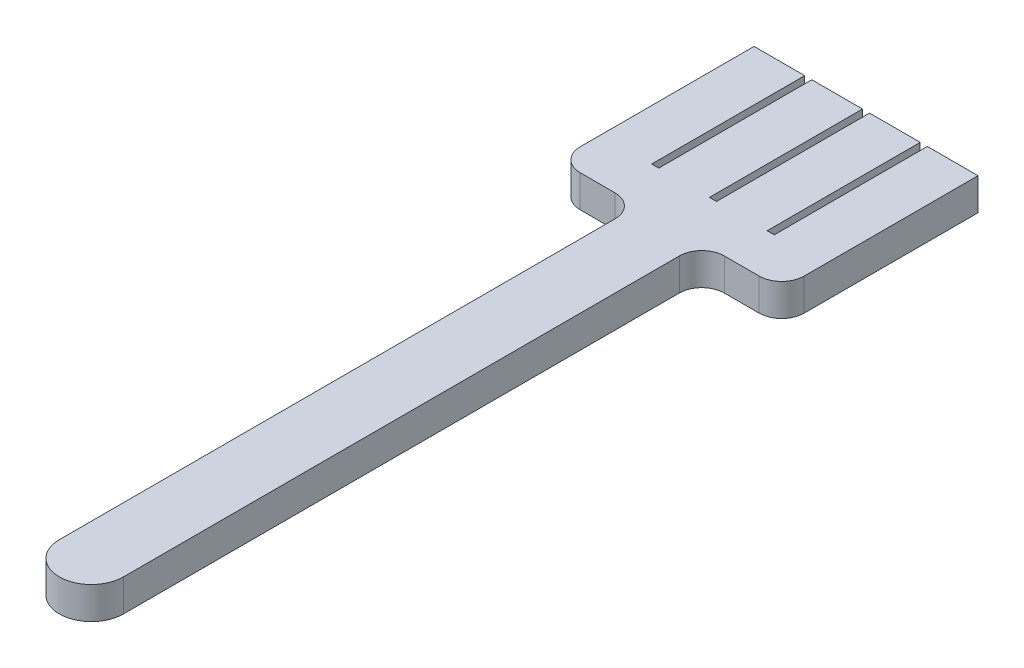
ISO-10303-21;
HEADER;
FILE_DESCRIPTION(('STEP AP214'),'2;1');
FILE_NAME('part.step','',(''),(''),'','','');
FILE_SCHEMA(('AUTOMOTIVE_DESIGN { 1 0 10303 214 1 1 1 1 }'));
ENDSEC;
DATA;
#1=APPLICATION_CONTEXT('core data for automotive mechanical design processes');
#2=APPLICATION_PROTOCOL_DEFINITION('international standard','automotive_design',2000,#1);
#3=PRODUCT_CONTEXT('',#1,'mechanical');
#4=PRODUCT('Part','Part','',(#3));
#5=PRODUCT_RELATED_PRODUCT_CATEGORY('part','',(#4));
#6=PRODUCT_DEFINITION_FORMATION('','',#4);
#7=PRODUCT_DEFINITION_CONTEXT('part definition',#1,'design');
#8=PRODUCT_DEFINITION('design','',#6,#7);
#9=PRODUCT_DEFINITION_SHAPE('','',#8);
#10=(LENGTH_UNIT() NAMED_UNIT(*) SI_UNIT(.MILLI.,.METRE.));
#11=(NAMED_UNIT(*) PLANE_ANGLE_UNIT() SI_UNIT($,.RADIAN.));
#12=(NAMED_UNIT(*) SI_UNIT($,.STERADIAN.) SOLID_ANGLE_UNIT());
#13=UNCERTAINTY_MEASURE_WITH_UNIT(LENGTH_MEASURE(1.E-05),#10,'distance_accuracy_value','');
#14=(GEOMETRIC_REPRESENTATION_CONTEXT(3) GLOBAL_UNCERTAINTY_ASSIGNED_CONTEXT((#13)) GLOBAL_UNIT_ASSIGNED_CONTEXT((#10,
#11,#12)) REPRESENTATION_CONTEXT('',''));
#15=CARTESIAN_POINT('',(0.,0.,0.));
#16=DIRECTION('',(0.,0.,1.));
#17=DIRECTION('',(1.,0.,0.));
#18=AXIS2_PLACEMENT_3D('',#15,#16,#17);
#19=CARTESIAN_POINT('',(10.,10.,0.));
#20=DIRECTION('',(0.,-1.,0.));
#21=DIRECTION('',(0.,0.,-1.));
#22=AXIS2_PLACEMENT_3D('',#19,#20,#21);
#23=CYLINDRICAL_SURFACE('',#22,10.);
#24=CARTESIAN_POINT('',(10.,0.,0.));
#25=DIRECTION('',(0.,1.,0.));
#26=DIRECTION('',(0.,0.,-1.));
#27=AXIS2_PLACEMENT_3D('',#24,#25,#26);
#28=CIRCLE('',#27,10.);
#29=CARTESIAN_POINT('',(0.,0.,0.));
#30=VERTEX_POINT('',#29);
#31=CARTESIAN_POINT('',(20.,0.,0.));
#32=VERTEX_POINT('',#31);
#33=EDGE_CURVE('E221',#30,#32,#28,.T.);
#34=ORIENTED_EDGE('',*,*,#33,.T.);
#35=DIRECTION('',(0.,-1.,0.));
#36=VECTOR('',#35,1.);
#37=CARTESIAN_POINT('',(20.,10.,0.));
#38=LINE('',#37,#36);
#39=CARTESIAN_POINT('',(20.,10.,0.));
#40=VERTEX_POINT('',#39);
#41=EDGE_CURVE('E203',#40,#32,#38,.T.);
#42=ORIENTED_EDGE('',*,*,#41,.F.);
#43=CARTESIAN_POINT('',(10.,10.,0.));
#44=DIRECTION('',(0.,1.,0.));
#45=DIRECTION('',(0.,0.,-1.));
#46=AXIS2_PLACEMENT_3D('',#43,#44,#45);
#47=CIRCLE('',#46,10.);
#48=CARTESIAN_POINT('',(0.,10.,0.));
#49=VERTEX_POINT('',#48);
#50=EDGE_CURVE('E209',#49,#40,#47,.T.);
#51=ORIENTED_EDGE('',*,*,#50,.F.);
#52=DIRECTION('',(0.,-1.,0.));
#53=VECTOR('',#52,1.);
#54=CARTESIAN_POINT('',(0.,10.,0.));
#55=LINE('',#54,#53);
#56=EDGE_CURVE('E308',#49,#30,#55,.T.);
#57=ORIENTED_EDGE('',*,*,#56,.T.);
#58=EDGE_LOOP('',(#34,#42,#51,#57));
#59=FACE_BOUND('',#58,.T.);
#60=ADVANCED_FACE('F35',(#59),#23,.T.);
#61=CARTESIAN_POINT('',(20.,10.,-180.));
#62=DIRECTION('',(-1.,0.,0.));
#63=DIRECTION('',(0.,0.,1.));
#64=AXIS2_PLACEMENT_3D('',#61,#62,#63);
#65=PLANE('',#64);
#66=DIRECTION('',(0.,0.,-1.));
#67=VECTOR('',#66,1.);
#68=CARTESIAN_POINT('',(20.,0.,-180.));
#69=LINE('',#68,#67);
#70=CARTESIAN_POINT('',(20.,0.,-173.));
#71=VERTEX_POINT('',#70);
#72=EDGE_CURVE('E261',#32,#71,#69,.T.);
#73=ORIENTED_EDGE('',*,*,#72,.T.);
#74=DIRECTION('',(0.,-1.,0.));
#75=VECTOR('',#74,1.);
#76=CARTESIAN_POINT('',(20.,10.,-173.));
#77=LINE('',#76,#75);
#78=CARTESIAN_POINT('',(20.,10.,-173.));
#79=VERTEX_POINT('',#78);
#80=EDGE_CURVE('E206',#71,#79,#77,.F.);
#81=ORIENTED_EDGE('',*,*,#80,.T.);
#82=DIRECTION('',(0.,0.,-1.));
#83=VECTOR('',#82,1.);
#84=CARTESIAN_POINT('',(20.,10.,-180.));
#85=LINE('',#84,#83);
#86=EDGE_CURVE('E198',#40,#79,#85,.T.);
#87=ORIENTED_EDGE('',*,*,#86,.F.);
#88=ORIENTED_EDGE('',*,*,#41,.T.);
#89=EDGE_LOOP('',(#73,#81,#87,#88));
#90=FACE_BOUND('',#89,.T.);
#91=ADVANCED_FACE('F201',(#90),#65,.F.);
#92=CARTESIAN_POINT('',(44.8495337603184,10.,-180.));
#93=DIRECTION('',(0.,0.,-1.));
#94=DIRECTION('',(-1.,0.,0.));
#95=AXIS2_PLACEMENT_3D('',#92,#93,#94);
#96=PLANE('',#95);
#97=DIRECTION('',(1.,0.,0.));
#98=VECTOR('',#97,1.);
#99=CARTESIAN_POINT('',(44.8495337603184,10.,-180.));
#100=LINE('',#99,#98);
#101=CARTESIAN_POINT('',(27.,10.,-180.));
#102=VERTEX_POINT('',#101);
#103=CARTESIAN_POINT('',(37.8495337603184,10.,-180.));
#104=VERTEX_POINT('',#103);
#105=EDGE_CURVE('E208',#102,#104,#100,.T.);
#106=ORIENTED_EDGE('',*,*,#105,.F.);
#107=DIRECTION('',(0.,-1.,0.));
#108=VECTOR('',#107,1.);
#109=CARTESIAN_POINT('',(27.,0.,-180.));
#110=LINE('',#109,#108);
#111=CARTESIAN_POINT('',(27.,0.,-180.));
#112=VERTEX_POINT('',#111);
#113=EDGE_CURVE('E239',#102,#112,#110,.T.);
#114=ORIENTED_EDGE('',*,*,#113,.T.);
#115=DIRECTION('',(1.,0.,0.));
#116=VECTOR('',#115,1.);
#117=CARTESIAN_POINT('',(44.8495337603184,0.,-180.));
#118=LINE('',#117,#116);
#119=CARTESIAN_POINT('',(37.8495337603184,0.,-180.));
#120=VERTEX_POINT('',#119);
#121=EDGE_CURVE('E263',#112,#120,#118,.T.);
#122=ORIENTED_EDGE('',*,*,#121,.T.);
#123=DIRECTION('',(0.,-1.,0.));
#124=VECTOR('',#123,1.);
#125=CARTESIAN_POINT('',(37.8495337603184,10.,-180.));
#126=LINE('',#125,#124);
#127=EDGE_CURVE('E237',#120,#104,#126,.F.);
#128=ORIENTED_EDGE('',*,*,#127,.T.);
#129=EDGE_LOOP('',(#106,#114,#122,#128));
#130=FACE_BOUND('',#129,.T.);
#131=ADVANCED_FACE('F270',(#130),#96,.F.);
#132=CARTESIAN_POINT('',(44.8495337603184,10.,-241.105739003219));
#133=DIRECTION('',(-1.,0.,0.));
#134=DIRECTION('',(0.,0.,1.));
#135=AXIS2_PLACEMENT_3D('',#132,#133,#134);
#136=PLANE('',#135);
#137=DIRECTION('',(0.,0.,-1.));
#138=VECTOR('',#137,1.);
#139=CARTESIAN_POINT('',(44.8495337603184,10.,-241.105739003219));
#140=LINE('',#139,#138);
#141=CARTESIAN_POINT('',(44.8495337603184,10.,-187.));
#142=VERTEX_POINT('',#141);
#143=CARTESIAN_POINT('',(44.8495337603184,10.,-241.105739003219));
#144=VERTEX_POINT('',#143);
#145=EDGE_CURVE('E272',#142,#144,#140,.T.);
#146=ORIENTED_EDGE('',*,*,#145,.F.);
#147=DIRECTION('',(0.,-1.,0.));
#148=VECTOR('',#147,1.);
#149=CARTESIAN_POINT('',(44.8495337603184,10.,-187.));
#150=LINE('',#149,#148);
#151=CARTESIAN_POINT('',(44.8495337603184,0.,-187.));
#152=VERTEX_POINT('',#151);
#153=EDGE_CURVE('E251',#142,#152,#150,.T.);
#154=ORIENTED_EDGE('',*,*,#153,.T.);
#155=DIRECTION('',(0.,0.,-1.));
#156=VECTOR('',#155,1.);
#157=CARTESIAN_POINT('',(44.8495337603184,0.,-241.105739003219));
#158=LINE('',#157,#156);
#159=CARTESIAN_POINT('',(44.8495337603184,0.,-241.105739003219));
#160=VERTEX_POINT('',#159);
#161=EDGE_CURVE('E311',#152,#160,#158,.T.);
#162=ORIENTED_EDGE('',*,*,#161,.T.);
#163=DIRECTION('',(0.,-1.,0.));
#164=VECTOR('',#163,1.);
#165=CARTESIAN_POINT('',(44.8495337603184,10.,-241.105739003219));
#166=LINE('',#165,#164);
#167=EDGE_CURVE('E223',#144,#160,#166,.T.);
#168=ORIENTED_EDGE('',*,*,#167,.F.);
#169=EDGE_LOOP('',(#146,#154,#162,#168));
#170=FACE_BOUND('',#169,.T.);
#171=ADVANCED_FACE('F408',(#170),#136,.F.);
#172=CARTESIAN_POINT('',(29.0817218570607,10.,-241.105739003219));
#173=DIRECTION('',(0.,0.,1.));
#174=DIRECTION('',(1.,0.,0.));
#175=AXIS2_PLACEMENT_3D('',#172,#173,#174);
#176=PLANE('',#175);
#177=DIRECTION('',(-1.,0.,0.));
#178=VECTOR('',#177,1.);
#179=CARTESIAN_POINT('',(29.0817218570607,0.,-241.105739003219));
#180=LINE('',#179,#178);
#181=CARTESIAN_POINT('',(29.0817218570607,0.,-241.105739003219));
#182=VERTEX_POINT('',#181);
#183=EDGE_CURVE('E313',#160,#182,#180,.T.);
#184=ORIENTED_EDGE('',*,*,#183,.T.);
#185=DIRECTION('',(0.,-1.,0.));
#186=VECTOR('',#185,1.);
#187=CARTESIAN_POINT('',(29.0817218570607,10.,-241.105739003219));
#188=LINE('',#187,#186);
#189=CARTESIAN_POINT('',(29.0817218570607,10.,-241.105739003219));
#190=VERTEX_POINT('',#189);
#191=EDGE_CURVE('E229',#190,#182,#188,.T.);
#192=ORIENTED_EDGE('',*,*,#191,.F.);
#193=DIRECTION('',(-1.,0.,0.));
#194=VECTOR('',#193,1.);
#195=CARTESIAN_POINT('',(29.0817218570607,10.,-241.105739003219));
#196=LINE('',#195,#194);
#197=EDGE_CURVE('E274',#144,#190,#196,.T.);
#198=ORIENTED_EDGE('',*,*,#197,.F.);
#199=ORIENTED_EDGE('',*,*,#167,.T.);
#200=EDGE_LOOP('',(#184,#192,#198,#199));
#201=FACE_BOUND('',#200,.T.);
#202=ADVANCED_FACE('F406',(#201),#176,.F.);
#203=CARTESIAN_POINT('',(29.0817218570607,10.,-193.469393381457));
#204=DIRECTION('',(1.,0.,0.));
#205=DIRECTION('',(0.,0.,-1.));
#206=AXIS2_PLACEMENT_3D('',#203,#204,#205);
#207=PLANE('',#206);
#208=DIRECTION('',(0.,0.,1.));
#209=VECTOR('',#208,1.);
#210=CARTESIAN_POINT('',(29.0817218570607,0.,-193.469393381457));
#211=LINE('',#210,#209);
#212=CARTESIAN_POINT('',(29.0817218570607,0.,-193.469393381457));
#213=VERTEX_POINT('',#212);
#214=EDGE_CURVE('E315',#182,#213,#211,.T.);
#215=ORIENTED_EDGE('',*,*,#214,.T.);
#216=DIRECTION('',(0.,-1.,0.));
#217=VECTOR('',#216,1.);
#218=CARTESIAN_POINT('',(29.0817218570607,10.,-193.469393381457));
#219=LINE('',#218,#217);
#220=CARTESIAN_POINT('',(29.0817218570607,10.,-193.469393381457));
#221=VERTEX_POINT('',#220);
#222=EDGE_CURVE('E379',#221,#213,#219,.T.);
#223=ORIENTED_EDGE('',*,*,#222,.F.);
#224=DIRECTION('',(0.,0.,1.));
#225=VECTOR('',#224,1.);
#226=CARTESIAN_POINT('',(29.0817218570607,10.,-193.469393381457));
#227=LINE('',#226,#225);
#228=EDGE_CURVE('E278',#190,#221,#227,.T.);
#229=ORIENTED_EDGE('',*,*,#228,.F.);
#230=ORIENTED_EDGE('',*,*,#191,.T.);
#231=EDGE_LOOP('',(#215,#223,#229,#230));
#232=FACE_BOUND('',#231,.T.);
#233=ADVANCED_FACE('F386',(#232),#207,.F.);
#234=CARTESIAN_POINT('',(26.8724485545254,10.,-193.469393381457));
#235=DIRECTION('',(0.,0.,1.));
#236=DIRECTION('',(1.,0.,0.));
#237=AXIS2_PLACEMENT_3D('',#234,#235,#236);
#238=PLANE('',#237);
#239=DIRECTION('',(-1.,0.,0.));
#240=VECTOR('',#239,1.);
#241=CARTESIAN_POINT('',(26.8724485545254,0.,-193.469393381457));
#242=LINE('',#241,#240);
#243=CARTESIAN_POINT('',(26.8724485545254,0.,-193.469393381457));
#244=VERTEX_POINT('',#243);
#245=EDGE_CURVE('E317',#213,#244,#242,.T.);
#246=ORIENTED_EDGE('',*,*,#245,.T.);
#247=DIRECTION('',(0.,-1.,0.));
#248=VECTOR('',#247,1.);
#249=CARTESIAN_POINT('',(26.8724485545254,10.,-193.469393381457));
#250=LINE('',#249,#248);
#251=CARTESIAN_POINT('',(26.8724485545254,10.,-193.469393381457));
#252=VERTEX_POINT('',#251);
#253=EDGE_CURVE('E376',#252,#244,#250,.T.);
#254=ORIENTED_EDGE('',*,*,#253,.F.);
#255=DIRECTION('',(-1.,0.,0.));
#256=VECTOR('',#255,1.);
#257=CARTESIAN_POINT('',(26.8724485545254,10.,-193.469393381457));
#258=LINE('',#257,#256);
#259=EDGE_CURVE('E280',#221,#252,#258,.T.);
#260=ORIENTED_EDGE('',*,*,#259,.F.);
#261=ORIENTED_EDGE('',*,*,#222,.T.);
#262=EDGE_LOOP('',(#246,#254,#260,#261));
#263=FACE_BOUND('',#262,.T.);
#264=ADVANCED_FACE('F397',(#263),#238,.F.);
#265=CARTESIAN_POINT('',(26.8724485545254,10.,-241.105739003219));
#266=DIRECTION('',(-1.,0.,0.));
#267=DIRECTION('',(0.,0.,1.));
#268=AXIS2_PLACEMENT_3D('',#265,#266,#267);
#269=PLANE('',#268);
#270=DIRECTION('',(0.,0.,-1.));
#271=VECTOR('',#270,1.);
#272=CARTESIAN_POINT('',(26.8724485545254,0.,-241.105739003219));
#273=LINE('',#272,#271);
#274=CARTESIAN_POINT('',(26.8724485545254,0.,-241.105739003219));
#275=VERTEX_POINT('',#274);
#276=EDGE_CURVE('E319',#244,#275,#273,.T.);
#277=ORIENTED_EDGE('',*,*,#276,.T.);
#278=DIRECTION('',(0.,-1.,0.));
#279=VECTOR('',#278,1.);
#280=CARTESIAN_POINT('',(26.8724485545254,10.,-241.105739003219));
#281=LINE('',#280,#279);
#282=CARTESIAN_POINT('',(26.8724485545254,10.,-241.105739003219));
#283=VERTEX_POINT('',#282);
#284=EDGE_CURVE('E373',#283,#275,#281,.T.);
#285=ORIENTED_EDGE('',*,*,#284,.F.);
#286=DIRECTION('',(0.,0.,-1.));
#287=VECTOR('',#286,1.);
#288=CARTESIAN_POINT('',(26.8724485545254,10.,-241.105739003219));
#289=LINE('',#288,#287);
#290=EDGE_CURVE('E282',#252,#283,#289,.T.);
#291=ORIENTED_EDGE('',*,*,#290,.F.);
#292=ORIENTED_EDGE('',*,*,#253,.T.);
#293=EDGE_LOOP('',(#277,#285,#291,#292));
#294=FACE_BOUND('',#293,.T.);
#295=ADVANCED_FACE('F401',(#294),#269,.F.);
#296=CARTESIAN_POINT('',(11.1046366512677,10.,-241.105739003219));
#297=DIRECTION('',(0.,0.,1.));
#298=DIRECTION('',(1.,0.,0.));
#299=AXIS2_PLACEMENT_3D('',#296,#297,#298);
#300=PLANE('',#299);
#301=DIRECTION('',(-1.,0.,0.));
#302=VECTOR('',#301,1.);
#303=CARTESIAN_POINT('',(11.1046366512677,0.,-241.105739003219));
#304=LINE('',#303,#302);
#305=CARTESIAN_POINT('',(11.1046366512677,0.,-241.105739003219));
#306=VERTEX_POINT('',#305);
#307=EDGE_CURVE('E321',#275,#306,#304,.T.);
#308=ORIENTED_EDGE('',*,*,#307,.T.);
#309=DIRECTION('',(0.,-1.,0.));
#310=VECTOR('',#309,1.);
#311=CARTESIAN_POINT('',(11.1046366512677,10.,-241.105739003219));
#312=LINE('',#311,#310);
#313=CARTESIAN_POINT('',(11.1046366512677,10.,-241.105739003219));
#314=VERTEX_POINT('',#313);
#315=EDGE_CURVE('E370',#314,#306,#312,.T.);
#316=ORIENTED_EDGE('',*,*,#315,.F.);
#317=DIRECTION('',(-1.,0.,0.));
#318=VECTOR('',#317,1.);
#319=CARTESIAN_POINT('',(11.1046366512677,10.,-241.105739003219));
#320=LINE('',#319,#318);
#321=EDGE_CURVE('E284',#283,#314,#320,.T.);
#322=ORIENTED_EDGE('',*,*,#321,.F.);
#323=ORIENTED_EDGE('',*,*,#284,.T.);
#324=EDGE_LOOP('',(#308,#316,#322,#323));
#325=FACE_BOUND('',#324,.T.);
#326=ADVANCED_FACE('F564',(#325),#300,.F.);
#327=CARTESIAN_POINT('',(11.1046366512677,10.,-193.469393381457));
#328=DIRECTION('',(1.,0.,0.));
#329=DIRECTION('',(0.,0.,-1.));
#330=AXIS2_PLACEMENT_3D('',#327,#328,#329);
#331=PLANE('',#330);
#332=DIRECTION('',(0.,0.,1.));
#333=VECTOR('',#332,1.);
#334=CARTESIAN_POINT('',(11.1046366512677,0.,-193.469393381457));
#335=LINE('',#334,#333);
#336=CARTESIAN_POINT('',(11.1046366512677,0.,-193.469393381457));
#337=VERTEX_POINT('',#336);
#338=EDGE_CURVE('E323',#306,#337,#335,.T.);
#339=ORIENTED_EDGE('',*,*,#338,.T.);
#340=DIRECTION('',(0.,-1.,0.));
#341=VECTOR('',#340,1.);
#342=CARTESIAN_POINT('',(11.1046366512677,10.,-193.469393381457));
#343=LINE('',#342,#341);
#344=CARTESIAN_POINT('',(11.1046366512677,10.,-193.469393381457));
#345=VERTEX_POINT('',#344);
#346=EDGE_CURVE('E367',#345,#337,#343,.T.);
#347=ORIENTED_EDGE('',*,*,#346,.F.);
#348=DIRECTION('',(0.,0.,1.));
#349=VECTOR('',#348,1.);
#350=CARTESIAN_POINT('',(11.1046366512677,10.,-193.469393381457));
#351=LINE('',#350,#349);
#352=EDGE_CURVE('E286',#314,#345,#351,.T.);
#353=ORIENTED_EDGE('',*,*,#352,.F.);
#354=ORIENTED_EDGE('',*,*,#315,.T.);
#355=EDGE_LOOP('',(#339,#347,#353,#354));
#356=FACE_BOUND('',#355,.T.);
#357=ADVANCED_FACE('F555',(#356),#331,.F.);
#358=CARTESIAN_POINT('',(8.89536334873233,10.,-193.469393381457));
#359=DIRECTION('',(0.,0.,1.));
#360=DIRECTION('',(1.,0.,0.));
#361=AXIS2_PLACEMENT_3D('',#358,#359,#360);
#362=PLANE('',#361);
#363=DIRECTION('',(-1.,0.,0.));
#364=VECTOR('',#363,1.);
#365=CARTESIAN_POINT('',(8.89536334873233,0.,-193.469393381457));
#366=LINE('',#365,#364);
#367=CARTESIAN_POINT('',(8.89536334873233,0.,-193.469393381457));
#368=VERTEX_POINT('',#367);
#369=EDGE_CURVE('E325',#337,#368,#366,.T.);
#370=ORIENTED_EDGE('',*,*,#369,.T.);
#371=DIRECTION('',(0.,-1.,0.));
#372=VECTOR('',#371,1.);
#373=CARTESIAN_POINT('',(8.89536334873233,10.,-193.469393381457));
#374=LINE('',#373,#372);
#375=CARTESIAN_POINT('',(8.89536334873233,10.,-193.469393381457));
#376=VERTEX_POINT('',#375);
#377=EDGE_CURVE('E364',#376,#368,#374,.T.);
#378=ORIENTED_EDGE('',*,*,#377,.F.);
#379=DIRECTION('',(-1.,0.,0.));
#380=VECTOR('',#379,1.);
#381=CARTESIAN_POINT('',(8.89536334873233,10.,-193.469393381457));
#382=LINE('',#381,#380);
#383=EDGE_CURVE('E288',#345,#376,#382,.T.);
#384=ORIENTED_EDGE('',*,*,#383,.F.);
#385=ORIENTED_EDGE('',*,*,#346,.T.);
#386=EDGE_LOOP('',(#370,#378,#384,#385));
#387=FACE_BOUND('',#386,.T.);
#388=ADVANCED_FACE('F546',(#387),#362,.F.);
#389=CARTESIAN_POINT('',(8.89536334873233,10.,-241.105739003219));
#390=DIRECTION('',(-1.,0.,0.));
#391=DIRECTION('',(0.,0.,1.));
#392=AXIS2_PLACEMENT_3D('',#389,#390,#391);
#393=PLANE('',#392);
#394=DIRECTION('',(0.,0.,-1.));
#395=VECTOR('',#394,1.);
#396=CARTESIAN_POINT('',(8.89536334873233,0.,-241.105739003219));
#397=LINE('',#396,#395);
#398=CARTESIAN_POINT('',(8.89536334873233,0.,-241.105739003219));
#399=VERTEX_POINT('',#398);
#400=EDGE_CURVE('E327',#368,#399,#397,.T.);
#401=ORIENTED_EDGE('',*,*,#400,.T.);
#402=DIRECTION('',(0.,-1.,0.));
#403=VECTOR('',#402,1.);
#404=CARTESIAN_POINT('',(8.89536334873233,10.,-241.105739003219));
#405=LINE('',#404,#403);
#406=CARTESIAN_POINT('',(8.89536334873233,10.,-241.105739003219));
#407=VERTEX_POINT('',#406);
#408=EDGE_CURVE('E361',#407,#399,#405,.T.);
#409=ORIENTED_EDGE('',*,*,#408,.F.);
#410=DIRECTION('',(0.,0.,-1.));
#411=VECTOR('',#410,1.);
#412=CARTESIAN_POINT('',(8.89536334873233,10.,-241.105739003219));
#413=LINE('',#412,#411);
#414=EDGE_CURVE('E290',#376,#407,#413,.T.);
#415=ORIENTED_EDGE('',*,*,#414,.F.);
#416=ORIENTED_EDGE('',*,*,#377,.T.);
#417=EDGE_LOOP('',(#401,#409,#415,#416));
#418=FACE_BOUND('',#417,.T.);
#419=ADVANCED_FACE('F537',(#418),#393,.F.);
#420=CARTESIAN_POINT('',(-6.87244855452536,10.,-241.105739003219));
#421=DIRECTION('',(0.,0.,1.));
#422=DIRECTION('',(1.,0.,0.));
#423=AXIS2_PLACEMENT_3D('',#420,#421,#422);
#424=PLANE('',#423);
#425=DIRECTION('',(-1.,0.,0.));
#426=VECTOR('',#425,1.);
#427=CARTESIAN_POINT('',(-6.87244855452536,0.,-241.105739003219));
#428=LINE('',#427,#426);
#429=CARTESIAN_POINT('',(-6.87244855452536,0.,-241.105739003219));
#430=VERTEX_POINT('',#429);
#431=EDGE_CURVE('E329',#399,#430,#428,.T.);
#432=ORIENTED_EDGE('',*,*,#431,.T.);
#433=DIRECTION('',(0.,-1.,0.));
#434=VECTOR('',#433,1.);
#435=CARTESIAN_POINT('',(-6.87244855452536,10.,-241.105739003219));
#436=LINE('',#435,#434);
#437=CARTESIAN_POINT('',(-6.87244855452536,10.,-241.105739003219));
#438=VERTEX_POINT('',#437);
#439=EDGE_CURVE('E358',#438,#430,#436,.T.);
#440=ORIENTED_EDGE('',*,*,#439,.F.);
#441=DIRECTION('',(-1.,0.,0.));
#442=VECTOR('',#441,1.);
#443=CARTESIAN_POINT('',(-6.87244855452536,10.,-241.105739003219));
#444=LINE('',#443,#442);
#445=EDGE_CURVE('E292',#407,#438,#444,.T.);
#446=ORIENTED_EDGE('',*,*,#445,.F.);
#447=ORIENTED_EDGE('',*,*,#408,.T.);
#448=EDGE_LOOP('',(#432,#440,#446,#447));
#449=FACE_BOUND('',#448,.T.);
#450=ADVANCED_FACE('F528',(#449),#424,.F.);
#451=CARTESIAN_POINT('',(-6.87244855452537,10.,-193.469393381457));
#452=DIRECTION('',(1.,0.,0.));
#453=DIRECTION('',(0.,0.,-1.));
#454=AXIS2_PLACEMENT_3D('',#451,#452,#453);
#455=PLANE('',#454);
#456=DIRECTION('',(0.,0.,1.));
#457=VECTOR('',#456,1.);
#458=CARTESIAN_POINT('',(-6.87244855452537,0.,-193.469393381457));
#459=LINE('',#458,#457);
#460=CARTESIAN_POINT('',(-6.87244855452537,0.,-193.469393381457));
#461=VERTEX_POINT('',#460);
#462=EDGE_CURVE('E331',#430,#461,#459,.T.);
#463=ORIENTED_EDGE('',*,*,#462,.T.);
#464=DIRECTION('',(0.,-1.,0.));
#465=VECTOR('',#464,1.);
#466=CARTESIAN_POINT('',(-6.87244855452537,10.,-193.469393381457));
#467=LINE('',#466,#465);
#468=CARTESIAN_POINT('',(-6.87244855452537,10.,-193.469393381457));
#469=VERTEX_POINT('',#468);
#470=EDGE_CURVE('E355',#469,#461,#467,.T.);
#471=ORIENTED_EDGE('',*,*,#470,.F.);
#472=DIRECTION('',(0.,0.,1.));
#473=VECTOR('',#472,1.);
#474=CARTESIAN_POINT('',(-6.87244855452537,10.,-193.469393381457));
#475=LINE('',#474,#473);
#476=EDGE_CURVE('E294',#438,#469,#475,.T.);
#477=ORIENTED_EDGE('',*,*,#476,.F.);
#478=ORIENTED_EDGE('',*,*,#439,.T.);
#479=EDGE_LOOP('',(#463,#471,#477,#478));
#480=FACE_BOUND('',#479,.T.);
#481=ADVANCED_FACE('F519',(#480),#455,.F.);
#482=CARTESIAN_POINT('',(-9.0817218570607,10.,-193.469393381457));
#483=DIRECTION('',(0.,0.,1.));
#484=DIRECTION('',(1.,0.,0.));
#485=AXIS2_PLACEMENT_3D('',#482,#483,#484);
#486=PLANE('',#485);
#487=DIRECTION('',(-1.,0.,0.));
#488=VECTOR('',#487,1.);
#489=CARTESIAN_POINT('',(-9.0817218570607,0.,-193.469393381457));
#490=LINE('',#489,#488);
#491=CARTESIAN_POINT('',(-9.0817218570607,0.,-193.469393381457));
#492=VERTEX_POINT('',#491);
#493=EDGE_CURVE('E333',#461,#492,#490,.T.);
#494=ORIENTED_EDGE('',*,*,#493,.T.);
#495=DIRECTION('',(0.,-1.,0.));
#496=VECTOR('',#495,1.);
#497=CARTESIAN_POINT('',(-9.0817218570607,10.,-193.469393381457));
#498=LINE('',#497,#496);
#499=CARTESIAN_POINT('',(-9.0817218570607,10.,-193.469393381457));
#500=VERTEX_POINT('',#499);
#501=EDGE_CURVE('E352',#500,#492,#498,.T.);
#502=ORIENTED_EDGE('',*,*,#501,.F.);
#503=DIRECTION('',(-1.,0.,0.));
#504=VECTOR('',#503,1.);
#505=CARTESIAN_POINT('',(-9.0817218570607,10.,-193.469393381457));
#506=LINE('',#505,#504);
#507=EDGE_CURVE('E296',#469,#500,#506,.T.);
#508=ORIENTED_EDGE('',*,*,#507,.F.);
#509=ORIENTED_EDGE('',*,*,#470,.T.);
#510=EDGE_LOOP('',(#494,#502,#508,#509));
#511=FACE_BOUND('',#510,.T.);
#512=ADVANCED_FACE('F510',(#511),#486,.F.);
#513=CARTESIAN_POINT('',(-9.0817218570607,10.,-241.105739003219));
#514=DIRECTION('',(-1.,0.,0.));
#515=DIRECTION('',(0.,0.,1.));
#516=AXIS2_PLACEMENT_3D('',#513,#514,#515);
#517=PLANE('',#516);
#518=DIRECTION('',(0.,0.,-1.));
#519=VECTOR('',#518,1.);
#520=CARTESIAN_POINT('',(-9.0817218570607,0.,-241.105739003219));
#521=LINE('',#520,#519);
#522=CARTESIAN_POINT('',(-9.0817218570607,0.,-241.105739003219));
#523=VERTEX_POINT('',#522);
#524=EDGE_CURVE('E335',#492,#523,#521,.T.);
#525=ORIENTED_EDGE('',*,*,#524,.T.);
#526=DIRECTION('',(0.,-1.,0.));
#527=VECTOR('',#526,1.);
#528=CARTESIAN_POINT('',(-9.0817218570607,10.,-241.105739003219));
#529=LINE('',#528,#527);
#530=CARTESIAN_POINT('',(-9.0817218570607,10.,-241.105739003219));
#531=VERTEX_POINT('',#530);
#532=EDGE_CURVE('E349',#531,#523,#529,.T.);
#533=ORIENTED_EDGE('',*,*,#532,.F.);
#534=DIRECTION('',(0.,0.,-1.));
#535=VECTOR('',#534,1.);
#536=CARTESIAN_POINT('',(-9.0817218570607,10.,-241.105739003219));
#537=LINE('',#536,#535);
#538=EDGE_CURVE('E298',#500,#531,#537,.T.);
#539=ORIENTED_EDGE('',*,*,#538,.F.);
#540=ORIENTED_EDGE('',*,*,#501,.T.);
#541=EDGE_LOOP('',(#525,#533,#539,#540));
#542=FACE_BOUND('',#541,.T.);
#543=ADVANCED_FACE('F500',(#542),#517,.F.);
#544=CARTESIAN_POINT('',(-24.8495337603184,10.,-241.105739003219));
#545=DIRECTION('',(0.,0.,1.));
#546=DIRECTION('',(1.,0.,0.));
#547=AXIS2_PLACEMENT_3D('',#544,#545,#546);
#548=PLANE('',#547);
#549=DIRECTION('',(-1.,0.,0.));
#550=VECTOR('',#549,1.);
#551=CARTESIAN_POINT('',(-24.8495337603184,0.,-241.105739003219));
#552=LINE('',#551,#550);
#553=CARTESIAN_POINT('',(-24.8495337603184,0.,-241.105739003219));
#554=VERTEX_POINT('',#553);
#555=EDGE_CURVE('E337',#523,#554,#552,.T.);
#556=ORIENTED_EDGE('',*,*,#555,.T.);
#557=DIRECTION('',(0.,-1.,0.));
#558=VECTOR('',#557,1.);
#559=CARTESIAN_POINT('',(-24.8495337603184,10.,-241.105739003219));
#560=LINE('',#559,#558);
#561=CARTESIAN_POINT('',(-24.8495337603184,10.,-241.105739003219));
#562=VERTEX_POINT('',#561);
#563=EDGE_CURVE('E346',#562,#554,#560,.T.);
#564=ORIENTED_EDGE('',*,*,#563,.F.);
#565=DIRECTION('',(-1.,0.,0.));
#566=VECTOR('',#565,1.);
#567=CARTESIAN_POINT('',(-24.8495337603184,10.,-241.105739003219));
#568=LINE('',#567,#566);
#569=EDGE_CURVE('E300',#531,#562,#568,.T.);
#570=ORIENTED_EDGE('',*,*,#569,.F.);
#571=ORIENTED_EDGE('',*,*,#532,.T.);
#572=EDGE_LOOP('',(#556,#564,#570,#571));
#573=FACE_BOUND('',#572,.T.);
#574=ADVANCED_FACE('F491',(#573),#548,.F.);
#575=CARTESIAN_POINT('',(-24.8495337603184,10.,-180.));
#576=DIRECTION('',(1.,0.,0.));
#577=DIRECTION('',(0.,0.,-1.));
#578=AXIS2_PLACEMENT_3D('',#575,#576,#577);
#579=PLANE('',#578);
#580=DIRECTION('',(0.,0.,1.));
#581=VECTOR('',#580,1.);
#582=CARTESIAN_POINT('',(-24.8495337603184,0.,-180.));
#583=LINE('',#582,#581);
#584=CARTESIAN_POINT('',(-24.8495337603184,0.,-187.));
#585=VERTEX_POINT('',#584);
#586=EDGE_CURVE('E339',#554,#585,#583,.T.);
#587=ORIENTED_EDGE('',*,*,#586,.T.);
#588=DIRECTION('',(0.,-1.,0.));
#589=VECTOR('',#588,1.);
#590=CARTESIAN_POINT('',(-24.8495337603184,10.,-187.));
#591=LINE('',#590,#589);
#592=CARTESIAN_POINT('',(-24.8495337603184,10.,-187.));
#593=VERTEX_POINT('',#592);
#594=EDGE_CURVE('E58',#585,#593,#591,.F.);
#595=ORIENTED_EDGE('',*,*,#594,.T.);
#596=DIRECTION('',(0.,0.,1.));
#597=VECTOR('',#596,1.);
#598=CARTESIAN_POINT('',(-24.8495337603184,10.,-180.));
#599=LINE('',#598,#597);
#600=EDGE_CURVE('E302',#562,#593,#599,.T.);
#601=ORIENTED_EDGE('',*,*,#600,.F.);
#602=ORIENTED_EDGE('',*,*,#563,.T.);
#603=EDGE_LOOP('',(#587,#595,#601,#602));
#604=FACE_BOUND('',#603,.T.);
#605=ADVANCED_FACE('F482',(#604),#579,.F.);
#606=CARTESIAN_POINT('',(0.,10.,-180.));
#607=DIRECTION('',(0.,0.,-1.));
#608=DIRECTION('',(-1.,0.,0.));
#609=AXIS2_PLACEMENT_3D('',#606,#607,#608);
#610=PLANE('',#609);
#611=DIRECTION('',(1.,0.,0.));
#612=VECTOR('',#611,1.);
#613=CARTESIAN_POINT('',(0.,0.,-180.));
#614=LINE('',#613,#612);
#615=CARTESIAN_POINT('',(-17.8495337603184,0.,-180.));
#616=VERTEX_POINT('',#615);
#617=CARTESIAN_POINT('',(-7.,0.,-180.));
#618=VERTEX_POINT('',#617);
#619=EDGE_CURVE('E341',#616,#618,#614,.T.);
#620=ORIENTED_EDGE('',*,*,#619,.T.);
#621=DIRECTION('',(0.,-1.,0.));
#622=VECTOR('',#621,1.);
#623=CARTESIAN_POINT('',(-7.,10.,-180.));
#624=LINE('',#623,#622);
#625=CARTESIAN_POINT('',(-7.,10.,-180.));
#626=VERTEX_POINT('',#625);
#627=EDGE_CURVE('E235',#618,#626,#624,.F.);
#628=ORIENTED_EDGE('',*,*,#627,.T.);
#629=DIRECTION('',(1.,0.,0.));
#630=VECTOR('',#629,1.);
#631=CARTESIAN_POINT('',(0.,10.,-180.));
#632=LINE('',#631,#630);
#633=CARTESIAN_POINT('',(-17.8495337603184,10.,-180.));
#634=VERTEX_POINT('',#633);
#635=EDGE_CURVE('E304',#634,#626,#632,.T.);
#636=ORIENTED_EDGE('',*,*,#635,.F.);
#637=DIRECTION('',(0.,-1.,0.));
#638=VECTOR('',#637,1.);
#639=CARTESIAN_POINT('',(-17.8495337603184,10.,-180.));
#640=LINE('',#639,#638);
#641=EDGE_CURVE('E226',#634,#616,#640,.T.);
#642=ORIENTED_EDGE('',*,*,#641,.T.);
#643=EDGE_LOOP('',(#620,#628,#636,#642));
#644=FACE_BOUND('',#643,.T.);
#645=ADVANCED_FACE('F473',(#644),#610,.F.);
#646=CARTESIAN_POINT('',(0.,10.,0.));
#647=DIRECTION('',(1.,0.,0.));
#648=DIRECTION('',(0.,0.,-1.));
#649=AXIS2_PLACEMENT_3D('',#646,#647,#648);
#650=PLANE('',#649);
#651=DIRECTION('',(0.,0.,1.));
#652=VECTOR('',#651,1.);
#653=CARTESIAN_POINT('',(0.,10.,0.));
#654=LINE('',#653,#652);
#655=CARTESIAN_POINT('',(0.,10.,-173.));
#656=VERTEX_POINT('',#655);
#657=EDGE_CURVE('E214',#656,#49,#654,.T.);
#658=ORIENTED_EDGE('',*,*,#657,.F.);
#659=DIRECTION('',(0.,-1.,0.));
#660=VECTOR('',#659,1.);
#661=CARTESIAN_POINT('',(0.,0.,-173.));
#662=LINE('',#661,#660);
#663=CARTESIAN_POINT('',(0.,0.,-173.));
#664=VERTEX_POINT('',#663);
#665=EDGE_CURVE('E222',#656,#664,#662,.T.);
#666=ORIENTED_EDGE('',*,*,#665,.T.);
#667=DIRECTION('',(0.,0.,1.));
#668=VECTOR('',#667,1.);
#669=CARTESIAN_POINT('',(0.,0.,0.));
#670=LINE('',#669,#668);
#671=EDGE_CURVE('E218',#664,#30,#670,.T.);
#672=ORIENTED_EDGE('',*,*,#671,.T.);
#673=ORIENTED_EDGE('',*,*,#56,.F.);
#674=EDGE_LOOP('',(#658,#666,#672,#673));
#675=FACE_BOUND('',#674,.T.);
#676=ADVANCED_FACE('F465',(#675),#650,.F.);
#677=CARTESIAN_POINT('',(10.,10.,0.));
#678=DIRECTION('',(0.,-1.,0.));
#679=DIRECTION('',(0.,0.,-1.));
#680=AXIS2_PLACEMENT_3D('',#677,#678,#679);
#681=PLANE('',#680);
#682=ORIENTED_EDGE('',*,*,#600,.T.);
#683=CARTESIAN_POINT('',(-17.8495337603184,10.,-187.));
#684=DIRECTION('',(0.,-1.,0.));
#685=DIRECTION('',(0.,0.,-1.));
#686=AXIS2_PLACEMENT_3D('',#683,#684,#685);
#687=CIRCLE('',#686,7.);
#688=EDGE_CURVE('E249',#593,#634,#687,.F.);
#689=ORIENTED_EDGE('',*,*,#688,.T.);
#690=ORIENTED_EDGE('',*,*,#635,.T.);
#691=CARTESIAN_POINT('',(-7.,10.,-173.));
#692=DIRECTION('',(0.,-1.,0.));
#693=DIRECTION('',(0.,0.,-1.));
#694=AXIS2_PLACEMENT_3D('',#691,#692,#693);
#695=CIRCLE('',#694,7.);
#696=EDGE_CURVE('E256',#626,#656,#695,.T.);
#697=ORIENTED_EDGE('',*,*,#696,.T.);
#698=ORIENTED_EDGE('',*,*,#657,.T.);
#699=ORIENTED_EDGE('',*,*,#50,.T.);
#700=ORIENTED_EDGE('',*,*,#86,.T.);
#701=CARTESIAN_POINT('',(27.,10.,-173.));
#702=DIRECTION('',(0.,-1.,0.));
#703=DIRECTION('',(0.,0.,-1.));
#704=AXIS2_PLACEMENT_3D('',#701,#702,#703);
#705=CIRCLE('',#704,7.);
#706=EDGE_CURVE('E11',#79,#102,#705,.T.);
#707=ORIENTED_EDGE('',*,*,#706,.T.);
#708=ORIENTED_EDGE('',*,*,#105,.T.);
#709=CARTESIAN_POINT('',(37.8495337603184,10.,-187.));
#710=DIRECTION('',(0.,-1.,0.));
#711=DIRECTION('',(0.,0.,-1.));
#712=AXIS2_PLACEMENT_3D('',#709,#710,#711);
#713=CIRCLE('',#712,7.);
#714=EDGE_CURVE('E50',#104,#142,#713,.F.);
#715=ORIENTED_EDGE('',*,*,#714,.T.);
#716=ORIENTED_EDGE('',*,*,#145,.T.);
#717=ORIENTED_EDGE('',*,*,#197,.T.);
#718=ORIENTED_EDGE('',*,*,#228,.T.);
#719=ORIENTED_EDGE('',*,*,#259,.T.);
#720=ORIENTED_EDGE('',*,*,#290,.T.);
#721=ORIENTED_EDGE('',*,*,#321,.T.);
#722=ORIENTED_EDGE('',*,*,#352,.T.);
#723=ORIENTED_EDGE('',*,*,#383,.T.);
#724=ORIENTED_EDGE('',*,*,#414,.T.);
#725=ORIENTED_EDGE('',*,*,#445,.T.);
#726=ORIENTED_EDGE('',*,*,#476,.T.);
#727=ORIENTED_EDGE('',*,*,#507,.T.);
#728=ORIENTED_EDGE('',*,*,#538,.T.);
#729=ORIENTED_EDGE('',*,*,#569,.T.);
#730=EDGE_LOOP('',(#682,#689,#690,#697,#698,#699,#700,#707,#708,#715,#716,#717,#718,#719,#720,
#721,#722,#723,#724,#725,#726,#727,#728,#729));
#731=FACE_BOUND('',#730,.T.);
#732=ADVANCED_FACE('F212',(#731),#681,.F.);
#733=CARTESIAN_POINT('',(10.,0.,0.));
#734=DIRECTION('',(0.,-1.,0.));
#735=DIRECTION('',(0.,0.,-1.));
#736=AXIS2_PLACEMENT_3D('',#733,#734,#735);
#737=PLANE('',#736);
#738=ORIENTED_EDGE('',*,*,#619,.F.);
#739=CARTESIAN_POINT('',(-17.8495337603184,0.,-187.));
#740=DIRECTION('',(0.,-1.,0.));
#741=DIRECTION('',(0.,0.,-1.));
#742=AXIS2_PLACEMENT_3D('',#739,#740,#741);
#743=CIRCLE('',#742,7.);
#744=EDGE_CURVE('E245',#616,#585,#743,.T.);
#745=ORIENTED_EDGE('',*,*,#744,.T.);
#746=ORIENTED_EDGE('',*,*,#586,.F.);
#747=ORIENTED_EDGE('',*,*,#555,.F.);
#748=ORIENTED_EDGE('',*,*,#524,.F.);
#749=ORIENTED_EDGE('',*,*,#493,.F.);
#750=ORIENTED_EDGE('',*,*,#462,.F.);
#751=ORIENTED_EDGE('',*,*,#431,.F.);
#752=ORIENTED_EDGE('',*,*,#400,.F.);
#753=ORIENTED_EDGE('',*,*,#369,.F.);
#754=ORIENTED_EDGE('',*,*,#338,.F.);
#755=ORIENTED_EDGE('',*,*,#307,.F.);
#756=ORIENTED_EDGE('',*,*,#276,.F.);
#757=ORIENTED_EDGE('',*,*,#245,.F.);
#758=ORIENTED_EDGE('',*,*,#214,.F.);
#759=ORIENTED_EDGE('',*,*,#183,.F.);
#760=ORIENTED_EDGE('',*,*,#161,.F.);
#761=CARTESIAN_POINT('',(37.8495337603184,0.,-187.));
#762=DIRECTION('',(0.,-1.,0.));
#763=DIRECTION('',(0.,0.,-1.));
#764=AXIS2_PLACEMENT_3D('',#761,#762,#763);
#765=CIRCLE('',#764,7.);
#766=EDGE_CURVE('E243',#152,#120,#765,.T.);
#767=ORIENTED_EDGE('',*,*,#766,.T.);
#768=ORIENTED_EDGE('',*,*,#121,.F.);
#769=CARTESIAN_POINT('',(27.,0.,-173.));
#770=DIRECTION('',(0.,-1.,0.));
#771=DIRECTION('',(0.,0.,-1.));
#772=AXIS2_PLACEMENT_3D('',#769,#770,#771);
#773=CIRCLE('',#772,7.);
#774=EDGE_CURVE('E43',#112,#71,#773,.F.);
#775=ORIENTED_EDGE('',*,*,#774,.T.);
#776=ORIENTED_EDGE('',*,*,#72,.F.);
#777=ORIENTED_EDGE('',*,*,#33,.F.);
#778=ORIENTED_EDGE('',*,*,#671,.F.);
#779=CARTESIAN_POINT('',(-7.,0.,-173.));
#780=DIRECTION('',(0.,-1.,0.));
#781=DIRECTION('',(0.,0.,-1.));
#782=AXIS2_PLACEMENT_3D('',#779,#780,#781);
#783=CIRCLE('',#782,7.);
#784=EDGE_CURVE('E254',#664,#618,#783,.F.);
#785=ORIENTED_EDGE('',*,*,#784,.T.);
#786=EDGE_LOOP('',(#738,#745,#746,#747,#748,#749,#750,#751,#752,#753,#754,#755,#756,#757,#758,
#759,#760,#767,#768,#775,#776,#777,#778,#785));
#787=FACE_BOUND('',#786,.T.);
#788=ADVANCED_FACE('F260',(#787),#737,.T.);
#789=CARTESIAN_POINT('',(-7.,10.,-173.));
#790=DIRECTION('',(0.,1.,0.));
#791=DIRECTION('',(0.,0.,1.));
#792=AXIS2_PLACEMENT_3D('',#789,#790,#791);
#793=CYLINDRICAL_SURFACE('',#792,7.);
#794=ORIENTED_EDGE('',*,*,#696,.F.);
#795=ORIENTED_EDGE('',*,*,#627,.F.);
#796=ORIENTED_EDGE('',*,*,#784,.F.);
#797=ORIENTED_EDGE('',*,*,#665,.F.);
#798=EDGE_LOOP('',(#794,#795,#796,#797));
#799=FACE_BOUND('',#798,.T.);
#800=ADVANCED_FACE('F425',(#799),#793,.F.);
#801=CARTESIAN_POINT('',(27.,10.,-173.));
#802=DIRECTION('',(0.,1.,0.));
#803=DIRECTION('',(0.,0.,1.));
#804=AXIS2_PLACEMENT_3D('',#801,#802,#803);
#805=CYLINDRICAL_SURFACE('',#804,7.);
#806=ORIENTED_EDGE('',*,*,#706,.F.);
#807=ORIENTED_EDGE('',*,*,#80,.F.);
#808=ORIENTED_EDGE('',*,*,#774,.F.);
#809=ORIENTED_EDGE('',*,*,#113,.F.);
#810=EDGE_LOOP('',(#806,#807,#808,#809));
#811=FACE_BOUND('',#810,.T.);
#812=ADVANCED_FACE('F267',(#811),#805,.F.);
#813=CARTESIAN_POINT('',(-17.8495337603184,10.,-187.));
#814=DIRECTION('',(0.,-1.,0.));
#815=DIRECTION('',(0.,0.,-1.));
#816=AXIS2_PLACEMENT_3D('',#813,#814,#815);
#817=CYLINDRICAL_SURFACE('',#816,7.);
#818=ORIENTED_EDGE('',*,*,#688,.F.);
#819=ORIENTED_EDGE('',*,*,#594,.F.);
#820=ORIENTED_EDGE('',*,*,#744,.F.);
#821=ORIENTED_EDGE('',*,*,#641,.F.);
#822=EDGE_LOOP('',(#818,#819,#820,#821));
#823=FACE_BOUND('',#822,.T.);
#824=ADVANCED_FACE('F412',(#823),#817,.T.);
#825=CARTESIAN_POINT('',(37.8495337603184,10.,-187.));
#826=DIRECTION('',(0.,-1.,0.));
#827=DIRECTION('',(0.,0.,-1.));
#828=AXIS2_PLACEMENT_3D('',#825,#826,#827);
#829=CYLINDRICAL_SURFACE('',#828,7.);
#830=ORIENTED_EDGE('',*,*,#714,.F.);
#831=ORIENTED_EDGE('',*,*,#127,.F.);
#832=ORIENTED_EDGE('',*,*,#766,.F.);
#833=ORIENTED_EDGE('',*,*,#153,.F.);
#834=EDGE_LOOP('',(#830,#831,#832,#833));
#835=FACE_BOUND('',#834,.T.);
#836=ADVANCED_FACE('F37',(#835),#829,.T.);
#837=CLOSED_SHELL('',(#60,#91,#131,#171,#202,#233,#264,#295,#326,#357,#388,#419,#450,#481,#512,
#543,#574,#605,#645,#676,#732,#788,#800,#812,#824,#836));
#838=MANIFOLD_SOLID_BREP('B2',#837);
#839=ADVANCED_BREP_SHAPE_REPRESENTATION('',(#18,#838),#14);
#840=SHAPE_DEFINITION_REPRESENTATION(#9,#839);
ENDSEC;
END-ISO-10303-21;
